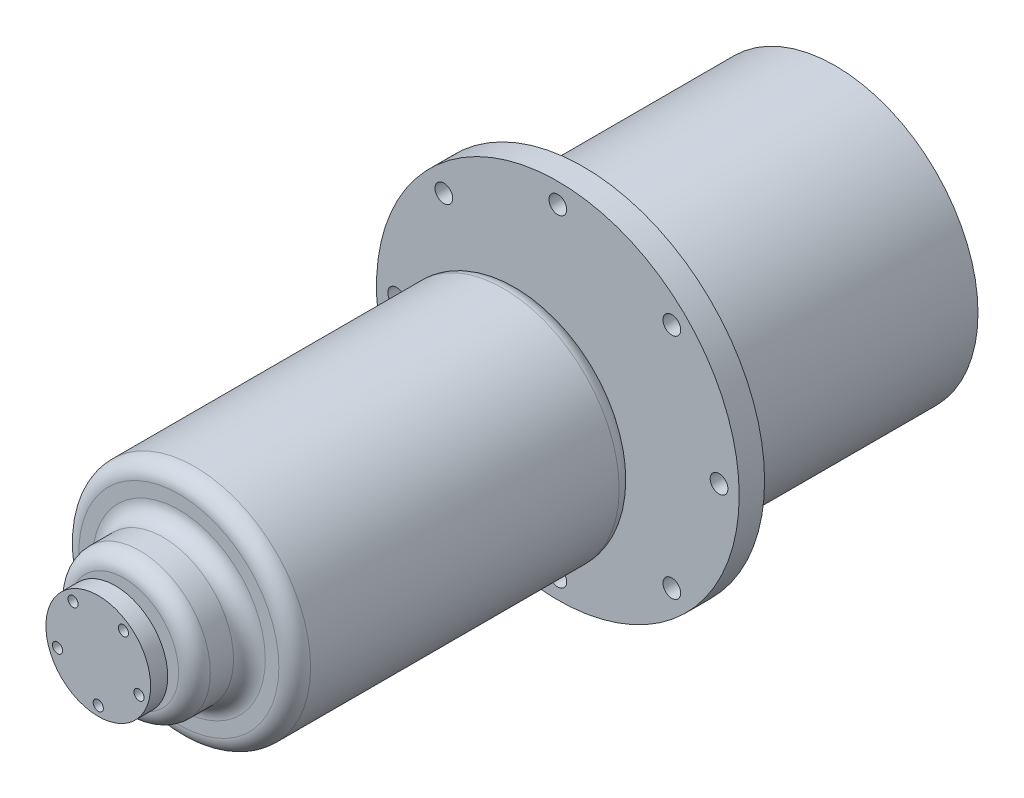
ISO-10303-21;
HEADER;
FILE_DESCRIPTION(('STEP AP214'),'2;1');
FILE_NAME('part.step','',(''),(''),'','','');
FILE_SCHEMA(('AUTOMOTIVE_DESIGN { 1 0 10303 214 1 1 1 1 }'));
ENDSEC;
DATA;
#1=APPLICATION_CONTEXT('core data for automotive mechanical design processes');
#2=APPLICATION_PROTOCOL_DEFINITION('international standard','automotive_design',2000,#1);
#3=PRODUCT_CONTEXT('',#1,'mechanical');
#4=PRODUCT('Part','Part','',(#3));
#5=PRODUCT_RELATED_PRODUCT_CATEGORY('part','',(#4));
#6=PRODUCT_DEFINITION_FORMATION('','',#4);
#7=PRODUCT_DEFINITION_CONTEXT('part definition',#1,'design');
#8=PRODUCT_DEFINITION('design','',#6,#7);
#9=PRODUCT_DEFINITION_SHAPE('','',#8);
#10=(LENGTH_UNIT() NAMED_UNIT(*) SI_UNIT(.MILLI.,.METRE.));
#11=(NAMED_UNIT(*) PLANE_ANGLE_UNIT() SI_UNIT($,.RADIAN.));
#12=(NAMED_UNIT(*) SI_UNIT($,.STERADIAN.) SOLID_ANGLE_UNIT());
#13=UNCERTAINTY_MEASURE_WITH_UNIT(LENGTH_MEASURE(1.E-05),#10,'distance_accuracy_value','');
#14=(GEOMETRIC_REPRESENTATION_CONTEXT(3) GLOBAL_UNCERTAINTY_ASSIGNED_CONTEXT((#13)) GLOBAL_UNIT_ASSIGNED_CONTEXT((#10,
#11,#12)) REPRESENTATION_CONTEXT('',''));
#15=CARTESIAN_POINT('',(0.,0.,0.));
#16=DIRECTION('',(0.,0.,1.));
#17=DIRECTION('',(1.,0.,0.));
#18=AXIS2_PLACEMENT_3D('',#15,#16,#17);
#19=CARTESIAN_POINT('',(0.,0.,-4.));
#20=DIRECTION('',(0.,0.,1.));
#21=DIRECTION('',(1.,0.,0.));
#22=AXIS2_PLACEMENT_3D('',#19,#20,#21);
#23=PLANE('',#22);
#24=CARTESIAN_POINT('',(0.,0.,-4.));
#25=DIRECTION('',(0.,0.,1.));
#26=DIRECTION('',(1.,0.,0.));
#27=AXIS2_PLACEMENT_3D('',#24,#25,#26);
#28=CIRCLE('',#27,57.15);
#29=CARTESIAN_POINT('',(57.15,0.,-4.));
#30=VERTEX_POINT('',#29);
#31=EDGE_CURVE('E67',#30,#30,#28,.T.);
#32=ORIENTED_EDGE('',*,*,#31,.F.);
#33=EDGE_LOOP('',(#32));
#34=FACE_BOUND('',#33,.T.);
#35=CARTESIAN_POINT('',(0.,50.8,-4.));
#36=DIRECTION('',(0.,0.,-1.));
#37=DIRECTION('',(-1.,0.,0.));
#38=AXIS2_PLACEMENT_3D('',#35,#36,#37);
#39=CIRCLE('',#38,2.79);
#40=CARTESIAN_POINT('',(-2.79,50.8,-4.));
#41=VERTEX_POINT('',#40);
#42=EDGE_CURVE('E123',#41,#41,#39,.T.);
#43=ORIENTED_EDGE('',*,*,#42,.F.);
#44=EDGE_LOOP('',(#43));
#45=FACE_BOUND('',#44,.T.);
#46=CARTESIAN_POINT('',(-35.9210244842766,35.9210244842766,-4.));
#47=DIRECTION('',(0.,0.,-1.));
#48=DIRECTION('',(-1.,0.,0.));
#49=AXIS2_PLACEMENT_3D('',#46,#47,#48);
#50=CIRCLE('',#49,2.79);
#51=CARTESIAN_POINT('',(-38.7110244842766,35.9210244842766,-4.));
#52=VERTEX_POINT('',#51);
#53=EDGE_CURVE('E129',#52,#52,#50,.T.);
#54=ORIENTED_EDGE('',*,*,#53,.F.);
#55=EDGE_LOOP('',(#54));
#56=FACE_BOUND('',#55,.T.);
#57=CARTESIAN_POINT('',(-50.8,0.,-4.));
#58=DIRECTION('',(0.,0.,-1.));
#59=DIRECTION('',(-1.,0.,0.));
#60=AXIS2_PLACEMENT_3D('',#57,#58,#59);
#61=CIRCLE('',#60,2.79);
#62=CARTESIAN_POINT('',(-53.59,0.,-4.));
#63=VERTEX_POINT('',#62);
#64=EDGE_CURVE('E135',#63,#63,#61,.T.);
#65=ORIENTED_EDGE('',*,*,#64,.F.);
#66=EDGE_LOOP('',(#65));
#67=FACE_BOUND('',#66,.T.);
#68=CARTESIAN_POINT('',(-35.9210244842765,-35.9210244842767,-4.));
#69=DIRECTION('',(0.,0.,-1.));
#70=DIRECTION('',(-1.,0.,0.));
#71=AXIS2_PLACEMENT_3D('',#68,#69,#70);
#72=CIRCLE('',#71,2.79);
#73=CARTESIAN_POINT('',(-38.7110244842765,-35.9210244842767,-4.));
#74=VERTEX_POINT('',#73);
#75=EDGE_CURVE('E141',#74,#74,#72,.T.);
#76=ORIENTED_EDGE('',*,*,#75,.F.);
#77=EDGE_LOOP('',(#76));
#78=FACE_BOUND('',#77,.T.);
#79=CARTESIAN_POINT('',(0.,-50.8,-4.));
#80=DIRECTION('',(0.,0.,-1.));
#81=DIRECTION('',(-1.,0.,0.));
#82=AXIS2_PLACEMENT_3D('',#79,#80,#81);
#83=CIRCLE('',#82,2.79);
#84=CARTESIAN_POINT('',(-2.79,-50.8,-4.));
#85=VERTEX_POINT('',#84);
#86=EDGE_CURVE('E147',#85,#85,#83,.T.);
#87=ORIENTED_EDGE('',*,*,#86,.F.);
#88=EDGE_LOOP('',(#87));
#89=FACE_BOUND('',#88,.T.);
#90=CARTESIAN_POINT('',(35.9210244842766,-35.9210244842766,-4.));
#91=DIRECTION('',(0.,0.,-1.));
#92=DIRECTION('',(-1.,0.,0.));
#93=AXIS2_PLACEMENT_3D('',#90,#91,#92);
#94=CIRCLE('',#93,2.79);
#95=CARTESIAN_POINT('',(33.1310244842766,-35.9210244842766,-4.));
#96=VERTEX_POINT('',#95);
#97=EDGE_CURVE('E153',#96,#96,#94,.T.);
#98=ORIENTED_EDGE('',*,*,#97,.F.);
#99=EDGE_LOOP('',(#98));
#100=FACE_BOUND('',#99,.T.);
#101=CARTESIAN_POINT('',(50.8,0.,-4.));
#102=DIRECTION('',(0.,0.,-1.));
#103=DIRECTION('',(-1.,0.,0.));
#104=AXIS2_PLACEMENT_3D('',#101,#102,#103);
#105=CIRCLE('',#104,2.79);
#106=CARTESIAN_POINT('',(48.01,0.,-4.));
#107=VERTEX_POINT('',#106);
#108=EDGE_CURVE('E159',#107,#107,#105,.T.);
#109=ORIENTED_EDGE('',*,*,#108,.F.);
#110=EDGE_LOOP('',(#109));
#111=FACE_BOUND('',#110,.T.);
#112=CARTESIAN_POINT('',(35.9210244842766,35.9210244842767,-4.));
#113=DIRECTION('',(0.,0.,-1.));
#114=DIRECTION('',(-1.,0.,0.));
#115=AXIS2_PLACEMENT_3D('',#112,#113,#114);
#116=CIRCLE('',#115,2.79);
#117=CARTESIAN_POINT('',(33.1310244842766,35.9210244842767,-4.));
#118=VERTEX_POINT('',#117);
#119=EDGE_CURVE('E165',#118,#118,#116,.T.);
#120=ORIENTED_EDGE('',*,*,#119,.F.);
#121=EDGE_LOOP('',(#120));
#122=FACE_BOUND('',#121,.T.);
#123=CARTESIAN_POINT('',(0.,0.,-4.));
#124=DIRECTION('',(0.,0.,1.));
#125=DIRECTION('',(1.,0.,0.));
#126=AXIS2_PLACEMENT_3D('',#123,#124,#125);
#127=CIRCLE('',#126,45.);
#128=CARTESIAN_POINT('',(45.,0.,-4.));
#129=VERTEX_POINT('',#128);
#130=EDGE_CURVE('E63',#129,#129,#127,.F.);
#131=ORIENTED_EDGE('',*,*,#130,.F.);
#132=EDGE_LOOP('',(#131));
#133=FACE_BOUND('',#132,.T.);
#134=ADVANCED_FACE('F31',(#34,#45,#56,#67,#78,#89,#100,#111,#122,#133),#23,.F.);
#135=CARTESIAN_POINT('',(0.,0.,140.7288));
#136=DIRECTION('',(0.,0.,1.));
#137=DIRECTION('',(1.,0.,0.));
#138=AXIS2_PLACEMENT_3D('',#135,#136,#137);
#139=PLANE('',#138);
#140=CARTESIAN_POINT('',(0.,0.,140.7288));
#141=DIRECTION('',(0.,0.,1.));
#142=DIRECTION('',(1.,0.,0.));
#143=AXIS2_PLACEMENT_3D('',#140,#141,#142);
#144=CIRCLE('',#143,17.225);
#145=CARTESIAN_POINT('',(17.225,0.,140.7288));
#146=VERTEX_POINT('',#145);
#147=EDGE_CURVE('E60',#146,#146,#144,.T.);
#148=ORIENTED_EDGE('',*,*,#147,.T.);
#149=EDGE_LOOP('',(#148));
#150=FACE_BOUND('',#149,.T.);
#151=CARTESIAN_POINT('',(0.,0.,140.7288));
#152=DIRECTION('',(0.,0.,1.));
#153=DIRECTION('',(1.,0.,0.));
#154=AXIS2_PLACEMENT_3D('',#151,#152,#153);
#155=CIRCLE('',#154,9.525);
#156=CARTESIAN_POINT('',(9.525,0.,140.7288));
#157=VERTEX_POINT('',#156);
#158=EDGE_CURVE('E79',#157,#157,#155,.T.);
#159=ORIENTED_EDGE('',*,*,#158,.F.);
#160=EDGE_LOOP('',(#159));
#161=FACE_BOUND('',#160,.T.);
#162=ADVANCED_FACE('F182',(#150,#161),#139,.T.);
#163=CARTESIAN_POINT('',(0.,0.,123.406));
#164=DIRECTION('',(0.,0.,1.));
#165=DIRECTION('',(1.,0.,0.));
#166=AXIS2_PLACEMENT_3D('',#163,#164,#165);
#167=PLANE('',#166);
#168=CARTESIAN_POINT('',(0.,0.,123.406));
#169=DIRECTION('',(0.,0.,1.));
#170=DIRECTION('',(1.,0.,0.));
#171=AXIS2_PLACEMENT_3D('',#168,#169,#170);
#172=CIRCLE('',#171,27.225);
#173=CARTESIAN_POINT('',(27.225,0.,123.406));
#174=VERTEX_POINT('',#173);
#175=EDGE_CURVE('E46',#174,#174,#172,.F.);
#176=ORIENTED_EDGE('',*,*,#175,.T.);
#177=EDGE_LOOP('',(#176));
#178=FACE_BOUND('',#177,.T.);
#179=CARTESIAN_POINT('',(0.,0.,123.406));
#180=DIRECTION('',(0.,0.,1.));
#181=DIRECTION('',(1.,0.,0.));
#182=AXIS2_PLACEMENT_3D('',#179,#180,#181);
#183=CIRCLE('',#182,31.5);
#184=CARTESIAN_POINT('',(31.5,0.,123.406));
#185=VERTEX_POINT('',#184);
#186=EDGE_CURVE('E51',#185,#185,#183,.T.);
#187=ORIENTED_EDGE('',*,*,#186,.T.);
#188=EDGE_LOOP('',(#187));
#189=FACE_BOUND('',#188,.T.);
#190=ADVANCED_FACE('F188',(#178,#189),#167,.T.);
#191=CARTESIAN_POINT('',(0.,0.,4.));
#192=DIRECTION('',(0.,0.,1.));
#193=DIRECTION('',(1.,0.,0.));
#194=AXIS2_PLACEMENT_3D('',#191,#192,#193);
#195=PLANE('',#194);
#196=CARTESIAN_POINT('',(35.9210244842766,35.9210244842767,4.));
#197=DIRECTION('',(0.,0.,1.));
#198=DIRECTION('',(1.,0.,0.));
#199=AXIS2_PLACEMENT_3D('',#196,#197,#198);
#200=CIRCLE('',#199,2.79);
#201=CARTESIAN_POINT('',(38.7110244842765,35.9210244842767,4.));
#202=VERTEX_POINT('',#201);
#203=EDGE_CURVE('E162',#202,#202,#200,.F.);
#204=ORIENTED_EDGE('',*,*,#203,.T.);
#205=EDGE_LOOP('',(#204));
#206=FACE_BOUND('',#205,.T.);
#207=CARTESIAN_POINT('',(50.8,0.,4.));
#208=DIRECTION('',(0.,0.,1.));
#209=DIRECTION('',(1.,0.,0.));
#210=AXIS2_PLACEMENT_3D('',#207,#208,#209);
#211=CIRCLE('',#210,2.79);
#212=CARTESIAN_POINT('',(53.59,0.,4.));
#213=VERTEX_POINT('',#212);
#214=EDGE_CURVE('E156',#213,#213,#211,.F.);
#215=ORIENTED_EDGE('',*,*,#214,.T.);
#216=EDGE_LOOP('',(#215));
#217=FACE_BOUND('',#216,.T.);
#218=CARTESIAN_POINT('',(35.9210244842766,-35.9210244842766,4.));
#219=DIRECTION('',(0.,0.,1.));
#220=DIRECTION('',(1.,0.,0.));
#221=AXIS2_PLACEMENT_3D('',#218,#219,#220);
#222=CIRCLE('',#221,2.79);
#223=CARTESIAN_POINT('',(38.7110244842766,-35.9210244842766,4.));
#224=VERTEX_POINT('',#223);
#225=EDGE_CURVE('E150',#224,#224,#222,.F.);
#226=ORIENTED_EDGE('',*,*,#225,.T.);
#227=EDGE_LOOP('',(#226));
#228=FACE_BOUND('',#227,.T.);
#229=CARTESIAN_POINT('',(0.,-50.8,4.));
#230=DIRECTION('',(0.,0.,1.));
#231=DIRECTION('',(1.,0.,0.));
#232=AXIS2_PLACEMENT_3D('',#229,#230,#231);
#233=CIRCLE('',#232,2.79);
#234=CARTESIAN_POINT('',(2.79,-50.8,4.));
#235=VERTEX_POINT('',#234);
#236=EDGE_CURVE('E144',#235,#235,#233,.F.);
#237=ORIENTED_EDGE('',*,*,#236,.T.);
#238=EDGE_LOOP('',(#237));
#239=FACE_BOUND('',#238,.T.);
#240=CARTESIAN_POINT('',(-35.9210244842765,-35.9210244842767,4.));
#241=DIRECTION('',(0.,0.,1.));
#242=DIRECTION('',(1.,0.,0.));
#243=AXIS2_PLACEMENT_3D('',#240,#241,#242);
#244=CIRCLE('',#243,2.79);
#245=CARTESIAN_POINT('',(-33.1310244842765,-35.9210244842767,4.));
#246=VERTEX_POINT('',#245);
#247=EDGE_CURVE('E138',#246,#246,#244,.F.);
#248=ORIENTED_EDGE('',*,*,#247,.T.);
#249=EDGE_LOOP('',(#248));
#250=FACE_BOUND('',#249,.T.);
#251=CARTESIAN_POINT('',(-50.8,0.,4.));
#252=DIRECTION('',(0.,0.,1.));
#253=DIRECTION('',(1.,0.,0.));
#254=AXIS2_PLACEMENT_3D('',#251,#252,#253);
#255=CIRCLE('',#254,2.79);
#256=CARTESIAN_POINT('',(-48.01,0.,4.));
#257=VERTEX_POINT('',#256);
#258=EDGE_CURVE('E132',#257,#257,#255,.F.);
#259=ORIENTED_EDGE('',*,*,#258,.T.);
#260=EDGE_LOOP('',(#259));
#261=FACE_BOUND('',#260,.T.);
#262=CARTESIAN_POINT('',(-35.9210244842766,35.9210244842766,4.));
#263=DIRECTION('',(0.,0.,1.));
#264=DIRECTION('',(1.,0.,0.));
#265=AXIS2_PLACEMENT_3D('',#262,#263,#264);
#266=CIRCLE('',#265,2.79);
#267=CARTESIAN_POINT('',(-33.1310244842766,35.9210244842766,4.));
#268=VERTEX_POINT('',#267);
#269=EDGE_CURVE('E126',#268,#268,#266,.F.);
#270=ORIENTED_EDGE('',*,*,#269,.T.);
#271=EDGE_LOOP('',(#270));
#272=FACE_BOUND('',#271,.T.);
#273=CARTESIAN_POINT('',(0.,50.8,4.));
#274=DIRECTION('',(0.,0.,1.));
#275=DIRECTION('',(1.,0.,0.));
#276=AXIS2_PLACEMENT_3D('',#273,#274,#275);
#277=CIRCLE('',#276,2.79);
#278=CARTESIAN_POINT('',(2.79,50.8,4.));
#279=VERTEX_POINT('',#278);
#280=EDGE_CURVE('E118',#279,#279,#277,.F.);
#281=ORIENTED_EDGE('',*,*,#280,.T.);
#282=EDGE_LOOP('',(#281));
#283=FACE_BOUND('',#282,.T.);
#284=CARTESIAN_POINT('',(0.,0.,4.));
#285=DIRECTION('',(0.,0.,1.));
#286=DIRECTION('',(1.,0.,0.));
#287=AXIS2_PLACEMENT_3D('',#284,#285,#286);
#288=CIRCLE('',#287,57.15);
#289=CARTESIAN_POINT('',(57.15,0.,4.));
#290=VERTEX_POINT('',#289);
#291=EDGE_CURVE('E66',#290,#290,#288,.T.);
#292=ORIENTED_EDGE('',*,*,#291,.T.);
#293=EDGE_LOOP('',(#292));
#294=FACE_BOUND('',#293,.T.);
#295=CARTESIAN_POINT('',(0.,0.,4.));
#296=DIRECTION('',(0.,0.,1.));
#297=DIRECTION('',(1.,0.,0.));
#298=AXIS2_PLACEMENT_3D('',#295,#296,#297);
#299=CIRCLE('',#298,7.5);
#300=CARTESIAN_POINT('',(7.5,0.,4.));
#301=VERTEX_POINT('',#300);
#302=EDGE_CURVE('E73',#301,#301,#299,.T.);
#303=ORIENTED_EDGE('',*,*,#302,.F.);
#304=EDGE_LOOP('',(#303));
#305=FACE_BOUND('',#304,.T.);
#306=ADVANCED_FACE('F195',(#206,#217,#228,#239,#250,#261,#272,#283,#294,#305),#195,.T.);
#307=CARTESIAN_POINT('',(0.,0.,4.));
#308=DIRECTION('',(0.,0.,-1.));
#309=DIRECTION('',(-1.,0.,0.));
#310=AXIS2_PLACEMENT_3D('',#307,#308,#309);
#311=CYLINDRICAL_SURFACE('',#310,57.15);
#312=ORIENTED_EDGE('',*,*,#291,.F.);
#313=EDGE_LOOP('',(#312));
#314=FACE_BOUND('',#313,.T.);
#315=ORIENTED_EDGE('',*,*,#31,.T.);
#316=EDGE_LOOP('',(#315));
#317=FACE_BOUND('',#316,.T.);
#318=ADVANCED_FACE('F197',(#314,#317),#311,.T.);
#319=CARTESIAN_POINT('',(0.,0.,16.166));
#320=DIRECTION('',(0.,0.,-1.));
#321=DIRECTION('',(-1.,0.,0.));
#322=AXIS2_PLACEMENT_3D('',#319,#320,#321);
#323=CYLINDRICAL_SURFACE('',#322,7.5);
#324=CARTESIAN_POINT('',(0.,0.,16.166));
#325=DIRECTION('',(0.,0.,1.));
#326=DIRECTION('',(1.,0.,0.));
#327=AXIS2_PLACEMENT_3D('',#324,#325,#326);
#328=CIRCLE('',#327,7.5);
#329=CARTESIAN_POINT('',(7.5,0.,16.166));
#330=VERTEX_POINT('',#329);
#331=EDGE_CURVE('E70',#330,#330,#328,.T.);
#332=ORIENTED_EDGE('',*,*,#331,.F.);
#333=EDGE_LOOP('',(#332));
#334=FACE_BOUND('',#333,.T.);
#335=ORIENTED_EDGE('',*,*,#302,.T.);
#336=EDGE_LOOP('',(#335));
#337=FACE_BOUND('',#336,.T.);
#338=ADVANCED_FACE('F200',(#334,#337),#323,.T.);
#339=CARTESIAN_POINT('',(0.,0.,16.166));
#340=DIRECTION('',(0.,0.,1.));
#341=DIRECTION('',(1.,0.,0.));
#342=AXIS2_PLACEMENT_3D('',#339,#340,#341);
#343=PLANE('',#342);
#344=CARTESIAN_POINT('',(0.,0.,16.166));
#345=DIRECTION('',(0.,0.,1.));
#346=DIRECTION('',(1.,0.,0.));
#347=AXIS2_PLACEMENT_3D('',#344,#345,#346);
#348=CIRCLE('',#347,31.5);
#349=CARTESIAN_POINT('',(31.5,0.,16.166));
#350=VERTEX_POINT('',#349);
#351=EDGE_CURVE('E10',#350,#350,#348,.F.);
#352=ORIENTED_EDGE('',*,*,#351,.T.);
#353=EDGE_LOOP('',(#352));
#354=FACE_BOUND('',#353,.T.);
#355=ORIENTED_EDGE('',*,*,#331,.T.);
#356=EDGE_LOOP('',(#355));
#357=FACE_BOUND('',#356,.T.);
#358=ADVANCED_FACE('F229',(#354,#357),#343,.F.);
#359=CARTESIAN_POINT('',(0.,0.,123.406));
#360=DIRECTION('',(0.,0.,-1.));
#361=DIRECTION('',(-1.,0.,0.));
#362=AXIS2_PLACEMENT_3D('',#359,#360,#361);
#363=CYLINDRICAL_SURFACE('',#362,36.5);
#364=CARTESIAN_POINT('',(0.,0.,118.406));
#365=DIRECTION('',(0.,0.,1.));
#366=DIRECTION('',(1.,0.,0.));
#367=AXIS2_PLACEMENT_3D('',#364,#365,#366);
#368=CIRCLE('',#367,36.5);
#369=CARTESIAN_POINT('',(36.5,0.,118.406));
#370=VERTEX_POINT('',#369);
#371=EDGE_CURVE('E38',#370,#370,#368,.F.);
#372=ORIENTED_EDGE('',*,*,#371,.T.);
#373=EDGE_LOOP('',(#372));
#374=FACE_BOUND('',#373,.T.);
#375=CARTESIAN_POINT('',(0.,0.,21.166));
#376=DIRECTION('',(0.,0.,1.));
#377=DIRECTION('',(1.,0.,0.));
#378=AXIS2_PLACEMENT_3D('',#375,#376,#377);
#379=CIRCLE('',#378,36.5);
#380=CARTESIAN_POINT('',(36.5,0.,21.166));
#381=VERTEX_POINT('',#380);
#382=EDGE_CURVE('E42',#381,#381,#379,.T.);
#383=ORIENTED_EDGE('',*,*,#382,.T.);
#384=EDGE_LOOP('',(#383));
#385=FACE_BOUND('',#384,.T.);
#386=ADVANCED_FACE('F232',(#374,#385),#363,.T.);
#387=CARTESIAN_POINT('',(0.,0.,140.7288));
#388=DIRECTION('',(0.,0.,-1.));
#389=DIRECTION('',(-1.,0.,0.));
#390=AXIS2_PLACEMENT_3D('',#387,#388,#389);
#391=CYLINDRICAL_SURFACE('',#390,22.225);
#392=CARTESIAN_POINT('',(0.,0.,135.7288));
#393=DIRECTION('',(0.,0.,1.));
#394=DIRECTION('',(1.,0.,0.));
#395=AXIS2_PLACEMENT_3D('',#392,#393,#394);
#396=CIRCLE('',#395,22.225);
#397=CARTESIAN_POINT('',(22.225,0.,135.7288));
#398=VERTEX_POINT('',#397);
#399=EDGE_CURVE('E54',#398,#398,#396,.F.);
#400=ORIENTED_EDGE('',*,*,#399,.T.);
#401=EDGE_LOOP('',(#400));
#402=FACE_BOUND('',#401,.T.);
#403=CARTESIAN_POINT('',(0.,0.,128.406));
#404=DIRECTION('',(0.,0.,1.));
#405=DIRECTION('',(1.,0.,0.));
#406=AXIS2_PLACEMENT_3D('',#403,#404,#405);
#407=CIRCLE('',#406,22.225);
#408=CARTESIAN_POINT('',(22.225,0.,128.406));
#409=VERTEX_POINT('',#408);
#410=EDGE_CURVE('E57',#409,#409,#407,.T.);
#411=ORIENTED_EDGE('',*,*,#410,.T.);
#412=EDGE_LOOP('',(#411));
#413=FACE_BOUND('',#412,.T.);
#414=ADVANCED_FACE('F228',(#402,#413),#391,.T.);
#415=CARTESIAN_POINT('',(0.,0.,143.430852));
#416=DIRECTION('',(0.,0.,-1.));
#417=DIRECTION('',(-1.,0.,0.));
#418=AXIS2_PLACEMENT_3D('',#415,#416,#417);
#419=CYLINDRICAL_SURFACE('',#418,9.525);
#420=CARTESIAN_POINT('',(0.,0.,143.430852));
#421=DIRECTION('',(0.,0.,1.));
#422=DIRECTION('',(1.,0.,0.));
#423=AXIS2_PLACEMENT_3D('',#420,#421,#422);
#424=CIRCLE('',#423,9.525);
#425=CARTESIAN_POINT('',(9.525,0.,143.430852));
#426=VERTEX_POINT('',#425);
#427=EDGE_CURVE('E76',#426,#426,#424,.T.);
#428=ORIENTED_EDGE('',*,*,#427,.F.);
#429=EDGE_LOOP('',(#428));
#430=FACE_BOUND('',#429,.T.);
#431=ORIENTED_EDGE('',*,*,#158,.T.);
#432=EDGE_LOOP('',(#431));
#433=FACE_BOUND('',#432,.T.);
#434=ADVANCED_FACE('F260',(#430,#433),#419,.T.);
#435=CARTESIAN_POINT('',(0.,0.,143.430852));
#436=DIRECTION('',(0.,0.,1.));
#437=DIRECTION('',(1.,0.,0.));
#438=AXIS2_PLACEMENT_3D('',#435,#436,#437);
#439=PLANE('',#438);
#440=CARTESIAN_POINT('',(-12.8392629699845,-4.17172942406193,143.430852));
#441=DIRECTION('',(0.,0.,1.));
#442=DIRECTION('',(1.,0.,0.));
#443=AXIS2_PLACEMENT_3D('',#440,#441,#442);
#444=CIRCLE('',#443,1.6);
#445=CARTESIAN_POINT('',(-11.2392629699845,-4.17172942406193,143.430852));
#446=VERTEX_POINT('',#445);
#447=EDGE_CURVE('E112',#446,#446,#444,.T.);
#448=ORIENTED_EDGE('',*,*,#447,.T.);
#449=EDGE_LOOP('',(#448));
#450=FACE_BOUND('',#449,.T.);
#451=CARTESIAN_POINT('',(0.,-13.5,143.430852));
#452=DIRECTION('',(0.,0.,1.));
#453=DIRECTION('',(1.,0.,0.));
#454=AXIS2_PLACEMENT_3D('',#451,#452,#453);
#455=CIRCLE('',#454,1.6);
#456=CARTESIAN_POINT('',(1.6,-13.5,143.430852));
#457=VERTEX_POINT('',#456);
#458=EDGE_CURVE('E106',#457,#457,#455,.T.);
#459=ORIENTED_EDGE('',*,*,#458,.T.);
#460=EDGE_LOOP('',(#459));
#461=FACE_BOUND('',#460,.T.);
#462=CARTESIAN_POINT('',(12.8392629699846,-4.17172942406175,143.430852));
#463=DIRECTION('',(0.,0.,1.));
#464=DIRECTION('',(1.,0.,0.));
#465=AXIS2_PLACEMENT_3D('',#462,#463,#464);
#466=CIRCLE('',#465,1.6);
#467=CARTESIAN_POINT('',(14.4392629699846,-4.17172942406175,143.430852));
#468=VERTEX_POINT('',#467);
#469=EDGE_CURVE('E100',#468,#468,#466,.T.);
#470=ORIENTED_EDGE('',*,*,#469,.T.);
#471=EDGE_LOOP('',(#470));
#472=FACE_BOUND('',#471,.T.);
#473=CARTESIAN_POINT('',(7.93510090594833,10.9217294240618,143.430852));
#474=DIRECTION('',(0.,0.,1.));
#475=DIRECTION('',(1.,0.,0.));
#476=AXIS2_PLACEMENT_3D('',#473,#474,#475);
#477=CIRCLE('',#476,1.6);
#478=CARTESIAN_POINT('',(9.53510090594833,10.9217294240618,143.430852));
#479=VERTEX_POINT('',#478);
#480=EDGE_CURVE('E94',#479,#479,#477,.T.);
#481=ORIENTED_EDGE('',*,*,#480,.T.);
#482=EDGE_LOOP('',(#481));
#483=FACE_BOUND('',#482,.T.);
#484=CARTESIAN_POINT('',(-7.93510090594848,10.9217294240617,143.430852));
#485=DIRECTION('',(0.,0.,1.));
#486=DIRECTION('',(1.,0.,0.));
#487=AXIS2_PLACEMENT_3D('',#484,#485,#486);
#488=CIRCLE('',#487,1.6);
#489=CARTESIAN_POINT('',(-6.33510090594848,10.9217294240617,143.430852));
#490=VERTEX_POINT('',#489);
#491=EDGE_CURVE('E88',#490,#490,#488,.T.);
#492=ORIENTED_EDGE('',*,*,#491,.T.);
#493=EDGE_LOOP('',(#492));
#494=FACE_BOUND('',#493,.T.);
#495=CARTESIAN_POINT('',(0.,0.,143.430852));
#496=DIRECTION('',(0.,0.,1.));
#497=DIRECTION('',(1.,0.,0.));
#498=AXIS2_PLACEMENT_3D('',#495,#496,#497);
#499=CIRCLE('',#498,16.5);
#500=CARTESIAN_POINT('',(16.5,0.,143.430852));
#501=VERTEX_POINT('',#500);
#502=EDGE_CURVE('E85',#501,#501,#499,.T.);
#503=ORIENTED_EDGE('',*,*,#502,.F.);
#504=EDGE_LOOP('',(#503));
#505=FACE_BOUND('',#504,.T.);
#506=ORIENTED_EDGE('',*,*,#427,.T.);
#507=EDGE_LOOP('',(#506));
#508=FACE_BOUND('',#507,.T.);
#509=ADVANCED_FACE('F267',(#450,#461,#472,#483,#494,#505,#508),#439,.F.);
#510=CARTESIAN_POINT('',(0.,0.,148.815652));
#511=DIRECTION('',(0.,0.,-1.));
#512=DIRECTION('',(-1.,0.,0.));
#513=AXIS2_PLACEMENT_3D('',#510,#511,#512);
#514=CYLINDRICAL_SURFACE('',#513,16.5);
#515=CARTESIAN_POINT('',(0.,0.,148.815652));
#516=DIRECTION('',(0.,0.,1.));
#517=DIRECTION('',(1.,0.,0.));
#518=AXIS2_PLACEMENT_3D('',#515,#516,#517);
#519=CIRCLE('',#518,16.5);
#520=CARTESIAN_POINT('',(16.5,0.,148.815652));
#521=VERTEX_POINT('',#520);
#522=EDGE_CURVE('E82',#521,#521,#519,.T.);
#523=ORIENTED_EDGE('',*,*,#522,.F.);
#524=EDGE_LOOP('',(#523));
#525=FACE_BOUND('',#524,.T.);
#526=ORIENTED_EDGE('',*,*,#502,.T.);
#527=EDGE_LOOP('',(#526));
#528=FACE_BOUND('',#527,.T.);
#529=ADVANCED_FACE('F276',(#525,#528),#514,.T.);
#530=CARTESIAN_POINT('',(0.,0.,148.815652));
#531=DIRECTION('',(0.,0.,1.));
#532=DIRECTION('',(1.,0.,0.));
#533=AXIS2_PLACEMENT_3D('',#530,#531,#532);
#534=PLANE('',#533);
#535=CARTESIAN_POINT('',(-12.8392629699845,-4.17172942406193,148.815652));
#536=DIRECTION('',(0.,0.,1.));
#537=DIRECTION('',(1.,0.,0.));
#538=AXIS2_PLACEMENT_3D('',#535,#536,#537);
#539=CIRCLE('',#538,1.6);
#540=CARTESIAN_POINT('',(-11.2392629699845,-4.17172942406193,148.815652));
#541=VERTEX_POINT('',#540);
#542=EDGE_CURVE('E115',#541,#541,#539,.T.);
#543=ORIENTED_EDGE('',*,*,#542,.F.);
#544=EDGE_LOOP('',(#543));
#545=FACE_BOUND('',#544,.T.);
#546=CARTESIAN_POINT('',(0.,-13.5,148.815652));
#547=DIRECTION('',(0.,0.,1.));
#548=DIRECTION('',(1.,0.,0.));
#549=AXIS2_PLACEMENT_3D('',#546,#547,#548);
#550=CIRCLE('',#549,1.6);
#551=CARTESIAN_POINT('',(1.6,-13.5,148.815652));
#552=VERTEX_POINT('',#551);
#553=EDGE_CURVE('E109',#552,#552,#550,.T.);
#554=ORIENTED_EDGE('',*,*,#553,.F.);
#555=EDGE_LOOP('',(#554));
#556=FACE_BOUND('',#555,.T.);
#557=CARTESIAN_POINT('',(12.8392629699846,-4.17172942406175,148.815652));
#558=DIRECTION('',(0.,0.,1.));
#559=DIRECTION('',(1.,0.,0.));
#560=AXIS2_PLACEMENT_3D('',#557,#558,#559);
#561=CIRCLE('',#560,1.6);
#562=CARTESIAN_POINT('',(14.4392629699846,-4.17172942406175,148.815652));
#563=VERTEX_POINT('',#562);
#564=EDGE_CURVE('E103',#563,#563,#561,.T.);
#565=ORIENTED_EDGE('',*,*,#564,.F.);
#566=EDGE_LOOP('',(#565));
#567=FACE_BOUND('',#566,.T.);
#568=CARTESIAN_POINT('',(7.93510090594833,10.9217294240618,148.815652));
#569=DIRECTION('',(0.,0.,1.));
#570=DIRECTION('',(1.,0.,0.));
#571=AXIS2_PLACEMENT_3D('',#568,#569,#570);
#572=CIRCLE('',#571,1.6);
#573=CARTESIAN_POINT('',(9.53510090594833,10.9217294240618,148.815652));
#574=VERTEX_POINT('',#573);
#575=EDGE_CURVE('E97',#574,#574,#572,.T.);
#576=ORIENTED_EDGE('',*,*,#575,.F.);
#577=EDGE_LOOP('',(#576));
#578=FACE_BOUND('',#577,.T.);
#579=CARTESIAN_POINT('',(-7.93510090594848,10.9217294240617,148.815652));
#580=DIRECTION('',(0.,0.,1.));
#581=DIRECTION('',(1.,0.,0.));
#582=AXIS2_PLACEMENT_3D('',#579,#580,#581);
#583=CIRCLE('',#582,1.6);
#584=CARTESIAN_POINT('',(-6.33510090594848,10.9217294240617,148.815652));
#585=VERTEX_POINT('',#584);
#586=EDGE_CURVE('E91',#585,#585,#583,.T.);
#587=ORIENTED_EDGE('',*,*,#586,.F.);
#588=EDGE_LOOP('',(#587));
#589=FACE_BOUND('',#588,.T.);
#590=ORIENTED_EDGE('',*,*,#522,.T.);
#591=EDGE_LOOP('',(#590));
#592=FACE_BOUND('',#591,.T.);
#593=ADVANCED_FACE('F284',(#545,#556,#567,#578,#589,#592),#534,.T.);
#594=CARTESIAN_POINT('',(-7.93510090594848,10.9217294240617,143.430852));
#595=DIRECTION('',(0.,0.,1.));
#596=DIRECTION('',(1.,0.,0.));
#597=AXIS2_PLACEMENT_3D('',#594,#595,#596);
#598=CYLINDRICAL_SURFACE('',#597,1.6);
#599=ORIENTED_EDGE('',*,*,#491,.F.);
#600=EDGE_LOOP('',(#599));
#601=FACE_BOUND('',#600,.T.);
#602=ORIENTED_EDGE('',*,*,#586,.T.);
#603=EDGE_LOOP('',(#602));
#604=FACE_BOUND('',#603,.T.);
#605=ADVANCED_FACE('F291',(#601,#604),#598,.F.);
#606=CARTESIAN_POINT('',(7.93510090594833,10.9217294240618,143.430852));
#607=DIRECTION('',(0.,0.,1.));
#608=DIRECTION('',(1.,0.,0.));
#609=AXIS2_PLACEMENT_3D('',#606,#607,#608);
#610=CYLINDRICAL_SURFACE('',#609,1.6);
#611=ORIENTED_EDGE('',*,*,#480,.F.);
#612=EDGE_LOOP('',(#611));
#613=FACE_BOUND('',#612,.T.);
#614=ORIENTED_EDGE('',*,*,#575,.T.);
#615=EDGE_LOOP('',(#614));
#616=FACE_BOUND('',#615,.T.);
#617=ADVANCED_FACE('F299',(#613,#616),#610,.F.);
#618=CARTESIAN_POINT('',(12.8392629699846,-4.17172942406175,143.430852));
#619=DIRECTION('',(0.,0.,1.));
#620=DIRECTION('',(1.,0.,0.));
#621=AXIS2_PLACEMENT_3D('',#618,#619,#620);
#622=CYLINDRICAL_SURFACE('',#621,1.6);
#623=ORIENTED_EDGE('',*,*,#469,.F.);
#624=EDGE_LOOP('',(#623));
#625=FACE_BOUND('',#624,.T.);
#626=ORIENTED_EDGE('',*,*,#564,.T.);
#627=EDGE_LOOP('',(#626));
#628=FACE_BOUND('',#627,.T.);
#629=ADVANCED_FACE('F307',(#625,#628),#622,.F.);
#630=CARTESIAN_POINT('',(0.,-13.5,143.430852));
#631=DIRECTION('',(0.,0.,1.));
#632=DIRECTION('',(1.,0.,0.));
#633=AXIS2_PLACEMENT_3D('',#630,#631,#632);
#634=CYLINDRICAL_SURFACE('',#633,1.6);
#635=ORIENTED_EDGE('',*,*,#458,.F.);
#636=EDGE_LOOP('',(#635));
#637=FACE_BOUND('',#636,.T.);
#638=ORIENTED_EDGE('',*,*,#553,.T.);
#639=EDGE_LOOP('',(#638));
#640=FACE_BOUND('',#639,.T.);
#641=ADVANCED_FACE('F315',(#637,#640),#634,.F.);
#642=CARTESIAN_POINT('',(-12.8392629699845,-4.17172942406193,143.430852));
#643=DIRECTION('',(0.,0.,1.));
#644=DIRECTION('',(1.,0.,0.));
#645=AXIS2_PLACEMENT_3D('',#642,#643,#644);
#646=CYLINDRICAL_SURFACE('',#645,1.6);
#647=ORIENTED_EDGE('',*,*,#447,.F.);
#648=EDGE_LOOP('',(#647));
#649=FACE_BOUND('',#648,.T.);
#650=ORIENTED_EDGE('',*,*,#542,.T.);
#651=EDGE_LOOP('',(#650));
#652=FACE_BOUND('',#651,.T.);
#653=ADVANCED_FACE('F323',(#649,#652),#646,.F.);
#654=CARTESIAN_POINT('',(0.,50.8,11.8913116780419));
#655=DIRECTION('',(0.,0.,-1.));
#656=DIRECTION('',(-1.,0.,0.));
#657=AXIS2_PLACEMENT_3D('',#654,#655,#656);
#658=CYLINDRICAL_SURFACE('',#657,2.79);
#659=ORIENTED_EDGE('',*,*,#42,.T.);
#660=EDGE_LOOP('',(#659));
#661=FACE_BOUND('',#660,.T.);
#662=ORIENTED_EDGE('',*,*,#280,.F.);
#663=EDGE_LOOP('',(#662));
#664=FACE_BOUND('',#663,.T.);
#665=ADVANCED_FACE('F331',(#661,#664),#658,.F.);
#666=CARTESIAN_POINT('',(-35.9210244842766,35.9210244842766,11.8913116780419));
#667=DIRECTION('',(0.,0.,-1.));
#668=DIRECTION('',(-1.,0.,0.));
#669=AXIS2_PLACEMENT_3D('',#666,#667,#668);
#670=CYLINDRICAL_SURFACE('',#669,2.79);
#671=ORIENTED_EDGE('',*,*,#53,.T.);
#672=EDGE_LOOP('',(#671));
#673=FACE_BOUND('',#672,.T.);
#674=ORIENTED_EDGE('',*,*,#269,.F.);
#675=EDGE_LOOP('',(#674));
#676=FACE_BOUND('',#675,.T.);
#677=ADVANCED_FACE('F340',(#673,#676),#670,.F.);
#678=CARTESIAN_POINT('',(-50.8,0.,11.8913116780419));
#679=DIRECTION('',(0.,0.,-1.));
#680=DIRECTION('',(-1.,0.,0.));
#681=AXIS2_PLACEMENT_3D('',#678,#679,#680);
#682=CYLINDRICAL_SURFACE('',#681,2.79);
#683=ORIENTED_EDGE('',*,*,#64,.T.);
#684=EDGE_LOOP('',(#683));
#685=FACE_BOUND('',#684,.T.);
#686=ORIENTED_EDGE('',*,*,#258,.F.);
#687=EDGE_LOOP('',(#686));
#688=FACE_BOUND('',#687,.T.);
#689=ADVANCED_FACE('F348',(#685,#688),#682,.F.);
#690=CARTESIAN_POINT('',(-35.9210244842765,-35.9210244842767,11.8913116780419));
#691=DIRECTION('',(0.,0.,-1.));
#692=DIRECTION('',(-1.,0.,0.));
#693=AXIS2_PLACEMENT_3D('',#690,#691,#692);
#694=CYLINDRICAL_SURFACE('',#693,2.79);
#695=ORIENTED_EDGE('',*,*,#75,.T.);
#696=EDGE_LOOP('',(#695));
#697=FACE_BOUND('',#696,.T.);
#698=ORIENTED_EDGE('',*,*,#247,.F.);
#699=EDGE_LOOP('',(#698));
#700=FACE_BOUND('',#699,.T.);
#701=ADVANCED_FACE('F356',(#697,#700),#694,.F.);
#702=CARTESIAN_POINT('',(0.,-50.8,11.8913116780419));
#703=DIRECTION('',(0.,0.,-1.));
#704=DIRECTION('',(-1.,0.,0.));
#705=AXIS2_PLACEMENT_3D('',#702,#703,#704);
#706=CYLINDRICAL_SURFACE('',#705,2.79);
#707=ORIENTED_EDGE('',*,*,#86,.T.);
#708=EDGE_LOOP('',(#707));
#709=FACE_BOUND('',#708,.T.);
#710=ORIENTED_EDGE('',*,*,#236,.F.);
#711=EDGE_LOOP('',(#710));
#712=FACE_BOUND('',#711,.T.);
#713=ADVANCED_FACE('F364',(#709,#712),#706,.F.);
#714=CARTESIAN_POINT('',(35.9210244842766,-35.9210244842766,11.8913116780419));
#715=DIRECTION('',(0.,0.,-1.));
#716=DIRECTION('',(-1.,0.,0.));
#717=AXIS2_PLACEMENT_3D('',#714,#715,#716);
#718=CYLINDRICAL_SURFACE('',#717,2.79);
#719=ORIENTED_EDGE('',*,*,#97,.T.);
#720=EDGE_LOOP('',(#719));
#721=FACE_BOUND('',#720,.T.);
#722=ORIENTED_EDGE('',*,*,#225,.F.);
#723=EDGE_LOOP('',(#722));
#724=FACE_BOUND('',#723,.T.);
#725=ADVANCED_FACE('F372',(#721,#724),#718,.F.);
#726=CARTESIAN_POINT('',(50.8,0.,11.8913116780419));
#727=DIRECTION('',(0.,0.,-1.));
#728=DIRECTION('',(-1.,0.,0.));
#729=AXIS2_PLACEMENT_3D('',#726,#727,#728);
#730=CYLINDRICAL_SURFACE('',#729,2.79);
#731=ORIENTED_EDGE('',*,*,#108,.T.);
#732=EDGE_LOOP('',(#731));
#733=FACE_BOUND('',#732,.T.);
#734=ORIENTED_EDGE('',*,*,#214,.F.);
#735=EDGE_LOOP('',(#734));
#736=FACE_BOUND('',#735,.T.);
#737=ADVANCED_FACE('F380',(#733,#736),#730,.F.);
#738=CARTESIAN_POINT('',(35.9210244842766,35.9210244842767,11.8913116780419));
#739=DIRECTION('',(0.,0.,-1.));
#740=DIRECTION('',(-1.,0.,0.));
#741=AXIS2_PLACEMENT_3D('',#738,#739,#740);
#742=CYLINDRICAL_SURFACE('',#741,2.79);
#743=ORIENTED_EDGE('',*,*,#119,.T.);
#744=EDGE_LOOP('',(#743));
#745=FACE_BOUND('',#744,.T.);
#746=ORIENTED_EDGE('',*,*,#203,.F.);
#747=EDGE_LOOP('',(#746));
#748=FACE_BOUND('',#747,.T.);
#749=ADVANCED_FACE('F177',(#745,#748),#742,.F.);
#750=CARTESIAN_POINT('',(0.,0.,-83.4));
#751=DIRECTION('',(0.,0.,1.));
#752=DIRECTION('',(1.,0.,0.));
#753=AXIS2_PLACEMENT_3D('',#750,#751,#752);
#754=CYLINDRICAL_SURFACE('',#753,45.);
#755=CARTESIAN_POINT('',(0.,0.,-83.4));
#756=DIRECTION('',(0.,0.,-1.));
#757=DIRECTION('',(-1.,0.,0.));
#758=AXIS2_PLACEMENT_3D('',#755,#756,#757);
#759=CIRCLE('',#758,45.);
#760=CARTESIAN_POINT('',(-45.,0.,-83.4));
#761=VERTEX_POINT('',#760);
#762=EDGE_CURVE('E168',#761,#761,#759,.T.);
#763=ORIENTED_EDGE('',*,*,#762,.F.);
#764=EDGE_LOOP('',(#763));
#765=FACE_BOUND('',#764,.T.);
#766=ORIENTED_EDGE('',*,*,#130,.T.);
#767=EDGE_LOOP('',(#766));
#768=FACE_BOUND('',#767,.T.);
#769=ADVANCED_FACE('F174',(#765,#768),#754,.T.);
#770=CARTESIAN_POINT('',(0.,0.,-83.4));
#771=DIRECTION('',(0.,0.,-1.));
#772=DIRECTION('',(-1.,0.,0.));
#773=AXIS2_PLACEMENT_3D('',#770,#771,#772);
#774=PLANE('',#773);
#775=ORIENTED_EDGE('',*,*,#762,.T.);
#776=EDGE_LOOP('',(#775));
#777=FACE_BOUND('',#776,.T.);
#778=ADVANCED_FACE('F172',(#777),#774,.T.);
#779=CARTESIAN_POINT('',(0.,0.,135.7288));
#780=DIRECTION('',(0.,0.,1.));
#781=DIRECTION('',(1.,0.,0.));
#782=AXIS2_PLACEMENT_3D('',#779,#780,#781);
#783=TOROIDAL_SURFACE('',#782,17.225,5.);
#784=ORIENTED_EDGE('',*,*,#399,.F.);
#785=EDGE_LOOP('',(#784));
#786=FACE_BOUND('',#785,.T.);
#787=ORIENTED_EDGE('',*,*,#147,.F.);
#788=EDGE_LOOP('',(#787));
#789=FACE_BOUND('',#788,.T.);
#790=ADVANCED_FACE('F202',(#786,#789),#783,.T.);
#791=CARTESIAN_POINT('',(0.,0.,128.406));
#792=DIRECTION('',(0.,0.,1.));
#793=DIRECTION('',(1.,0.,0.));
#794=AXIS2_PLACEMENT_3D('',#791,#792,#793);
#795=TOROIDAL_SURFACE('',#794,27.225,5.);
#796=ORIENTED_EDGE('',*,*,#175,.F.);
#797=EDGE_LOOP('',(#796));
#798=FACE_BOUND('',#797,.T.);
#799=ORIENTED_EDGE('',*,*,#410,.F.);
#800=EDGE_LOOP('',(#799));
#801=FACE_BOUND('',#800,.T.);
#802=ADVANCED_FACE('F205',(#798,#801),#795,.F.);
#803=CARTESIAN_POINT('',(0.,0.,118.406));
#804=DIRECTION('',(0.,0.,1.));
#805=DIRECTION('',(1.,0.,0.));
#806=AXIS2_PLACEMENT_3D('',#803,#804,#805);
#807=TOROIDAL_SURFACE('',#806,31.5,5.);
#808=ORIENTED_EDGE('',*,*,#371,.F.);
#809=EDGE_LOOP('',(#808));
#810=FACE_BOUND('',#809,.T.);
#811=ORIENTED_EDGE('',*,*,#186,.F.);
#812=EDGE_LOOP('',(#811));
#813=FACE_BOUND('',#812,.T.);
#814=ADVANCED_FACE('F208',(#810,#813),#807,.T.);
#815=CARTESIAN_POINT('',(0.,0.,21.166));
#816=DIRECTION('',(0.,0.,1.));
#817=DIRECTION('',(1.,0.,0.));
#818=AXIS2_PLACEMENT_3D('',#815,#816,#817);
#819=TOROIDAL_SURFACE('',#818,31.5,5.);
#820=ORIENTED_EDGE('',*,*,#351,.F.);
#821=EDGE_LOOP('',(#820));
#822=FACE_BOUND('',#821,.T.);
#823=ORIENTED_EDGE('',*,*,#382,.F.);
#824=EDGE_LOOP('',(#823));
#825=FACE_BOUND('',#824,.T.);
#826=ADVANCED_FACE('F33',(#822,#825),#819,.T.);
#827=CLOSED_SHELL('',(#134,#162,#190,#306,#318,#338,#358,#386,#414,#434,#509,#529,#593,#605,
#617,#629,#641,#653,#665,#677,#689,#701,#713,#725,#737,#749,#769,#778,#790,#802,#814,#826));
#828=MANIFOLD_SOLID_BREP('B2',#827);
#829=ADVANCED_BREP_SHAPE_REPRESENTATION('',(#18,#828),#14);
#830=SHAPE_DEFINITION_REPRESENTATION(#9,#829);
ENDSEC;
END-ISO-10303-21;
